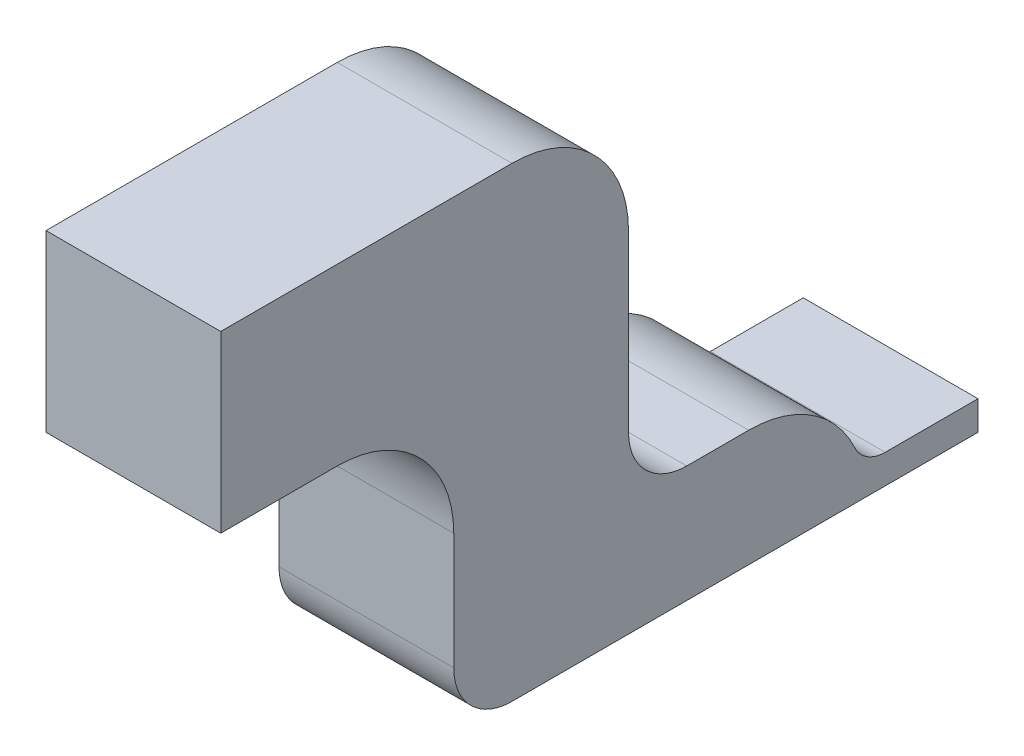
ISO-10303-21;
HEADER;
FILE_DESCRIPTION(('STEP AP214'),'2;1');
FILE_NAME('part.step','',(''),(''),'','','');
FILE_SCHEMA(('AUTOMOTIVE_DESIGN { 1 0 10303 214 1 1 1 1 }'));
ENDSEC;
DATA;
#1=APPLICATION_CONTEXT('core data for automotive mechanical design processes');
#2=APPLICATION_PROTOCOL_DEFINITION('international standard','automotive_design',2000,#1);
#3=PRODUCT_CONTEXT('',#1,'mechanical');
#4=PRODUCT('Part','Part','',(#3));
#5=PRODUCT_RELATED_PRODUCT_CATEGORY('part','',(#4));
#6=PRODUCT_DEFINITION_FORMATION('','',#4);
#7=PRODUCT_DEFINITION_CONTEXT('part definition',#1,'design');
#8=PRODUCT_DEFINITION('design','',#6,#7);
#9=PRODUCT_DEFINITION_SHAPE('','',#8);
#10=(LENGTH_UNIT() NAMED_UNIT(*) SI_UNIT(.MILLI.,.METRE.));
#11=(NAMED_UNIT(*) PLANE_ANGLE_UNIT() SI_UNIT($,.RADIAN.));
#12=(NAMED_UNIT(*) SI_UNIT($,.STERADIAN.) SOLID_ANGLE_UNIT());
#13=UNCERTAINTY_MEASURE_WITH_UNIT(LENGTH_MEASURE(1.E-05),#10,'distance_accuracy_value','');
#14=(GEOMETRIC_REPRESENTATION_CONTEXT(3) GLOBAL_UNCERTAINTY_ASSIGNED_CONTEXT((#13)) GLOBAL_UNIT_ASSIGNED_CONTEXT((#10,
#11,#12)) REPRESENTATION_CONTEXT('',''));
#15=CARTESIAN_POINT('',(0.,0.,0.));
#16=DIRECTION('',(0.,0.,1.));
#17=DIRECTION('',(1.,0.,0.));
#18=AXIS2_PLACEMENT_3D('',#15,#16,#17);
#19=CARTESIAN_POINT('',(0.,0.2,0.));
#20=DIRECTION('',(0.,0.,-1.));
#21=DIRECTION('',(-1.,0.,0.));
#22=AXIS2_PLACEMENT_3D('',#19,#20,#21);
#23=PLANE('',#22);
#24=DIRECTION('',(0.,-1.,0.));
#25=VECTOR('',#24,1.);
#26=CARTESIAN_POINT('',(0.,0.2,0.));
#27=LINE('',#26,#25);
#28=CARTESIAN_POINT('',(0.,0.3,0.));
#29=VERTEX_POINT('',#28);
#30=CARTESIAN_POINT('',(0.,0.1,0.));
#31=VERTEX_POINT('',#30);
#32=EDGE_CURVE('E255',#29,#31,#27,.T.);
#33=ORIENTED_EDGE('',*,*,#32,.T.);
#34=DIRECTION('',(1.,0.,0.));
#35=VECTOR('',#34,1.);
#36=CARTESIAN_POINT('',(0.3,0.1,0.));
#37=LINE('',#36,#35);
#38=CARTESIAN_POINT('',(0.3,0.1,0.));
#39=VERTEX_POINT('',#38);
#40=EDGE_CURVE('E230',#31,#39,#37,.T.);
#41=ORIENTED_EDGE('',*,*,#40,.T.);
#42=DIRECTION('',(0.,-1.,0.));
#43=VECTOR('',#42,1.);
#44=CARTESIAN_POINT('',(0.3,0.2,0.));
#45=LINE('',#44,#43);
#46=CARTESIAN_POINT('',(0.3,0.3,0.));
#47=VERTEX_POINT('',#46);
#48=EDGE_CURVE('E238',#47,#39,#45,.T.);
#49=ORIENTED_EDGE('',*,*,#48,.F.);
#50=DIRECTION('',(1.,0.,0.));
#51=VECTOR('',#50,1.);
#52=CARTESIAN_POINT('',(0.,0.3,0.));
#53=LINE('',#52,#51);
#54=EDGE_CURVE('E245',#47,#29,#53,.F.);
#55=ORIENTED_EDGE('',*,*,#54,.T.);
#56=EDGE_LOOP('',(#33,#41,#49,#55));
#57=FACE_BOUND('',#56,.T.);
#58=ADVANCED_FACE('F32',(#57),#23,.F.);
#59=CARTESIAN_POINT('',(0.,0.2,0.));
#60=DIRECTION('',(0.,-1.,0.));
#61=DIRECTION('',(0.,0.,-1.));
#62=AXIS2_PLACEMENT_3D('',#59,#60,#61);
#63=PLANE('',#62);
#64=DIRECTION('',(0.,0.,-1.));
#65=VECTOR('',#64,1.);
#66=CARTESIAN_POINT('',(0.3,0.2,0.));
#67=LINE('',#66,#65);
#68=CARTESIAN_POINT('',(0.3,0.2,-0.4));
#69=VERTEX_POINT('',#68);
#70=CARTESIAN_POINT('',(0.3,0.2,-0.506350832689628));
#71=VERTEX_POINT('',#70);
#72=EDGE_CURVE('E192',#69,#71,#67,.T.);
#73=ORIENTED_EDGE('',*,*,#72,.T.);
#74=DIRECTION('',(1.,0.,0.));
#75=VECTOR('',#74,1.);
#76=CARTESIAN_POINT('',(0.,0.2,-0.506350832689628));
#77=LINE('',#76,#75);
#78=CARTESIAN_POINT('',(0.,0.2,-0.506350832689628));
#79=VERTEX_POINT('',#78);
#80=EDGE_CURVE('E195',#71,#79,#77,.F.);
#81=ORIENTED_EDGE('',*,*,#80,.T.);
#82=DIRECTION('',(0.,0.,1.));
#83=VECTOR('',#82,1.);
#84=CARTESIAN_POINT('',(0.,0.2,0.));
#85=LINE('',#84,#83);
#86=CARTESIAN_POINT('',(0.,0.2,-0.4));
#87=VERTEX_POINT('',#86);
#88=EDGE_CURVE('E145',#79,#87,#85,.T.);
#89=ORIENTED_EDGE('',*,*,#88,.T.);
#90=DIRECTION('',(-1.,0.,0.));
#91=VECTOR('',#90,1.);
#92=CARTESIAN_POINT('',(0.3,0.2,-0.4));
#93=LINE('',#92,#91);
#94=EDGE_CURVE('E233',#87,#69,#93,.F.);
#95=ORIENTED_EDGE('',*,*,#94,.T.);
#96=EDGE_LOOP('',(#73,#81,#89,#95));
#97=FACE_BOUND('',#96,.T.);
#98=ADVANCED_FACE('F309',(#97),#63,.F.);
#99=CARTESIAN_POINT('',(0.,0.2,0.));
#100=DIRECTION('',(1.,0.,0.));
#101=DIRECTION('',(0.,0.,-1.));
#102=AXIS2_PLACEMENT_3D('',#99,#100,#101);
#103=PLANE('',#102);
#104=ORIENTED_EDGE('',*,*,#88,.F.);
#105=CARTESIAN_POINT('',(0.,0.,-0.506350832689628));
#106=DIRECTION('',(1.,0.,0.));
#107=DIRECTION('',(0.,0.,-1.));
#108=AXIS2_PLACEMENT_3D('',#105,#106,#107);
#109=CIRCLE('',#108,0.2);
#110=CARTESIAN_POINT('',(0.,0.0837209302325581,-0.687984546082806));
#111=VERTEX_POINT('',#110);
#112=EDGE_CURVE('E198',#79,#111,#109,.F.);
#113=ORIENTED_EDGE('',*,*,#112,.T.);
#114=CARTESIAN_POINT('',(0.,0.108,-0.740658322966828));
#115=DIRECTION('',(1.,0.,0.));
#116=DIRECTION('',(0.,0.,-1.));
#117=AXIS2_PLACEMENT_3D('',#114,#115,#116);
#118=CIRCLE('',#117,0.058);
#119=CARTESIAN_POINT('',(0.,0.05,-0.740658322966828));
#120=VERTEX_POINT('',#119);
#121=EDGE_CURVE('E11',#111,#120,#118,.T.);
#122=ORIENTED_EDGE('',*,*,#121,.T.);
#123=DIRECTION('',(0.,0.,1.));
#124=VECTOR('',#123,1.);
#125=CARTESIAN_POINT('',(0.,0.05,-0.899999999999999));
#126=LINE('',#125,#124);
#127=CARTESIAN_POINT('',(0.,0.05,-0.899999999999999));
#128=VERTEX_POINT('',#127);
#129=EDGE_CURVE('E169',#128,#120,#126,.T.);
#130=ORIENTED_EDGE('',*,*,#129,.F.);
#131=DIRECTION('',(0.,1.,0.));
#132=VECTOR('',#131,1.);
#133=CARTESIAN_POINT('',(0.,0.,-0.899999999999999));
#134=LINE('',#133,#132);
#135=CARTESIAN_POINT('',(0.,0.,-0.899999999999999));
#136=VERTEX_POINT('',#135);
#137=EDGE_CURVE('E154',#136,#128,#134,.T.);
#138=ORIENTED_EDGE('',*,*,#137,.F.);
#139=DIRECTION('',(0.,0.,1.));
#140=VECTOR('',#139,1.);
#141=CARTESIAN_POINT('',(0.,0.,0.));
#142=LINE('',#141,#140);
#143=CARTESIAN_POINT('',(0.,0.,-0.1));
#144=VERTEX_POINT('',#143);
#145=EDGE_CURVE('E146',#136,#144,#142,.T.);
#146=ORIENTED_EDGE('',*,*,#145,.T.);
#147=CARTESIAN_POINT('',(0.,0.1,-0.1));
#148=DIRECTION('',(1.,0.,0.));
#149=DIRECTION('',(0.,0.,-1.));
#150=AXIS2_PLACEMENT_3D('',#147,#148,#149);
#151=CIRCLE('',#150,0.1);
#152=EDGE_CURVE('E225',#144,#31,#151,.F.);
#153=ORIENTED_EDGE('',*,*,#152,.T.);
#154=ORIENTED_EDGE('',*,*,#32,.F.);
#155=CARTESIAN_POINT('',(0.,0.3,0.2));
#156=DIRECTION('',(1.,0.,0.));
#157=DIRECTION('',(0.,0.,-1.));
#158=AXIS2_PLACEMENT_3D('',#155,#156,#157);
#159=CIRCLE('',#158,0.2);
#160=CARTESIAN_POINT('',(0.,0.5,0.2));
#161=VERTEX_POINT('',#160);
#162=EDGE_CURVE('E241',#29,#161,#159,.T.);
#163=ORIENTED_EDGE('',*,*,#162,.T.);
#164=DIRECTION('',(0.,0.,-1.));
#165=VECTOR('',#164,1.);
#166=CARTESIAN_POINT('',(0.,0.5,0.4));
#167=LINE('',#166,#165);
#168=CARTESIAN_POINT('',(0.,0.5,0.4));
#169=VERTEX_POINT('',#168);
#170=EDGE_CURVE('E181',#169,#161,#167,.T.);
#171=ORIENTED_EDGE('',*,*,#170,.F.);
#172=DIRECTION('',(0.,-1.,0.));
#173=VECTOR('',#172,1.);
#174=CARTESIAN_POINT('',(0.,0.8,0.4));
#175=LINE('',#174,#173);
#176=CARTESIAN_POINT('',(0.,0.8,0.4));
#177=VERTEX_POINT('',#176);
#178=EDGE_CURVE('E165',#177,#169,#175,.T.);
#179=ORIENTED_EDGE('',*,*,#178,.F.);
#180=DIRECTION('',(0.,0.,1.));
#181=VECTOR('',#180,1.);
#182=CARTESIAN_POINT('',(0.,0.8,0.));
#183=LINE('',#182,#181);
#184=CARTESIAN_POINT('',(0.,0.8,-0.1));
#185=VERTEX_POINT('',#184);
#186=EDGE_CURVE('E178',#185,#177,#183,.T.);
#187=ORIENTED_EDGE('',*,*,#186,.F.);
#188=CARTESIAN_POINT('',(0.,0.6,-0.1));
#189=DIRECTION('',(1.,0.,0.));
#190=DIRECTION('',(0.,0.,-1.));
#191=AXIS2_PLACEMENT_3D('',#188,#189,#190);
#192=CIRCLE('',#191,0.2);
#193=CARTESIAN_POINT('',(0.,0.6,-0.3));
#194=VERTEX_POINT('',#193);
#195=EDGE_CURVE('E272',#185,#194,#192,.F.);
#196=ORIENTED_EDGE('',*,*,#195,.T.);
#197=DIRECTION('',(0.,-1.,0.));
#198=VECTOR('',#197,1.);
#199=CARTESIAN_POINT('',(0.,0.8,-0.3));
#200=LINE('',#199,#198);
#201=CARTESIAN_POINT('',(0.,0.3,-0.3));
#202=VERTEX_POINT('',#201);
#203=EDGE_CURVE('E184',#194,#202,#200,.T.);
#204=ORIENTED_EDGE('',*,*,#203,.T.);
#205=CARTESIAN_POINT('',(0.,0.3,-0.4));
#206=DIRECTION('',(1.,0.,0.));
#207=DIRECTION('',(0.,0.,-1.));
#208=AXIS2_PLACEMENT_3D('',#205,#206,#207);
#209=CIRCLE('',#208,0.1);
#210=EDGE_CURVE('E222',#202,#87,#209,.T.);
#211=ORIENTED_EDGE('',*,*,#210,.T.);
#212=EDGE_LOOP('',(#104,#113,#122,#130,#138,#146,#153,#154,#163,#171,#179,#187,#196,#204,#211));
#213=FACE_BOUND('',#212,.T.);
#214=ADVANCED_FACE('F302',(#213),#103,.F.);
#215=CARTESIAN_POINT('',(0.3,0.2,0.));
#216=DIRECTION('',(-1.,0.,0.));
#217=DIRECTION('',(0.,0.,1.));
#218=AXIS2_PLACEMENT_3D('',#215,#216,#217);
#219=PLANE('',#218);
#220=DIRECTION('',(0.,0.,1.));
#221=VECTOR('',#220,1.);
#222=CARTESIAN_POINT('',(0.3,0.05,-0.899999999999999));
#223=LINE('',#222,#221);
#224=CARTESIAN_POINT('',(0.3,0.05,-0.899999999999999));
#225=VERTEX_POINT('',#224);
#226=CARTESIAN_POINT('',(0.3,0.05,-0.740658322966828));
#227=VERTEX_POINT('',#226);
#228=EDGE_CURVE('E164',#225,#227,#223,.T.);
#229=ORIENTED_EDGE('',*,*,#228,.T.);
#230=CARTESIAN_POINT('',(0.3,0.108,-0.740658322966828));
#231=DIRECTION('',(-1.,0.,0.));
#232=DIRECTION('',(0.,0.,1.));
#233=AXIS2_PLACEMENT_3D('',#230,#231,#232);
#234=CIRCLE('',#233,0.058);
#235=CARTESIAN_POINT('',(0.3,0.0837209302325581,-0.687984546082806));
#236=VERTEX_POINT('',#235);
#237=EDGE_CURVE('E40',#227,#236,#234,.T.);
#238=ORIENTED_EDGE('',*,*,#237,.T.);
#239=CARTESIAN_POINT('',(0.3,0.,-0.506350832689628));
#240=DIRECTION('',(-1.,0.,0.));
#241=DIRECTION('',(0.,0.,1.));
#242=AXIS2_PLACEMENT_3D('',#239,#240,#241);
#243=CIRCLE('',#242,0.2);
#244=EDGE_CURVE('E201',#236,#71,#243,.F.);
#245=ORIENTED_EDGE('',*,*,#244,.T.);
#246=ORIENTED_EDGE('',*,*,#72,.F.);
#247=CARTESIAN_POINT('',(0.3,0.3,-0.4));
#248=DIRECTION('',(-1.,0.,0.));
#249=DIRECTION('',(0.,0.,1.));
#250=AXIS2_PLACEMENT_3D('',#247,#248,#249);
#251=CIRCLE('',#250,0.1);
#252=CARTESIAN_POINT('',(0.3,0.3,-0.3));
#253=VERTEX_POINT('',#252);
#254=EDGE_CURVE('E199',#69,#253,#251,.T.);
#255=ORIENTED_EDGE('',*,*,#254,.T.);
#256=DIRECTION('',(0.,-1.,0.));
#257=VECTOR('',#256,1.);
#258=CARTESIAN_POINT('',(0.3,0.8,-0.3));
#259=LINE('',#258,#257);
#260=CARTESIAN_POINT('',(0.3,0.6,-0.3));
#261=VERTEX_POINT('',#260);
#262=EDGE_CURVE('E271',#261,#253,#259,.T.);
#263=ORIENTED_EDGE('',*,*,#262,.F.);
#264=CARTESIAN_POINT('',(0.3,0.6,-0.1));
#265=DIRECTION('',(-1.,0.,0.));
#266=DIRECTION('',(0.,0.,1.));
#267=AXIS2_PLACEMENT_3D('',#264,#265,#266);
#268=CIRCLE('',#267,0.2);
#269=CARTESIAN_POINT('',(0.3,0.8,-0.1));
#270=VERTEX_POINT('',#269);
#271=EDGE_CURVE('E250',#261,#270,#268,.F.);
#272=ORIENTED_EDGE('',*,*,#271,.T.);
#273=DIRECTION('',(0.,0.,-1.));
#274=VECTOR('',#273,1.);
#275=CARTESIAN_POINT('',(0.3,0.8,0.));
#276=LINE('',#275,#274);
#277=CARTESIAN_POINT('',(0.3,0.8,0.4));
#278=VERTEX_POINT('',#277);
#279=EDGE_CURVE('E180',#278,#270,#276,.T.);
#280=ORIENTED_EDGE('',*,*,#279,.F.);
#281=DIRECTION('',(0.,1.,0.));
#282=VECTOR('',#281,1.);
#283=CARTESIAN_POINT('',(0.3,0.8,0.4));
#284=LINE('',#283,#282);
#285=CARTESIAN_POINT('',(0.3,0.5,0.4));
#286=VERTEX_POINT('',#285);
#287=EDGE_CURVE('E171',#286,#278,#284,.T.);
#288=ORIENTED_EDGE('',*,*,#287,.F.);
#289=DIRECTION('',(0.,0.,-1.));
#290=VECTOR('',#289,1.);
#291=CARTESIAN_POINT('',(0.3,0.5,0.4));
#292=LINE('',#291,#290);
#293=CARTESIAN_POINT('',(0.3,0.5,0.2));
#294=VERTEX_POINT('',#293);
#295=EDGE_CURVE('E177',#286,#294,#292,.T.);
#296=ORIENTED_EDGE('',*,*,#295,.T.);
#297=CARTESIAN_POINT('',(0.3,0.3,0.2));
#298=DIRECTION('',(-1.,0.,0.));
#299=DIRECTION('',(0.,0.,1.));
#300=AXIS2_PLACEMENT_3D('',#297,#298,#299);
#301=CIRCLE('',#300,0.2);
#302=EDGE_CURVE('E243',#294,#47,#301,.T.);
#303=ORIENTED_EDGE('',*,*,#302,.T.);
#304=ORIENTED_EDGE('',*,*,#48,.T.);
#305=CARTESIAN_POINT('',(0.3,0.1,-0.1));
#306=DIRECTION('',(-1.,0.,0.));
#307=DIRECTION('',(0.,0.,1.));
#308=AXIS2_PLACEMENT_3D('',#305,#306,#307);
#309=CIRCLE('',#308,0.1);
#310=CARTESIAN_POINT('',(0.3,0.,-0.1));
#311=VERTEX_POINT('',#310);
#312=EDGE_CURVE('E142',#39,#311,#309,.F.);
#313=ORIENTED_EDGE('',*,*,#312,.T.);
#314=DIRECTION('',(0.,0.,-1.));
#315=VECTOR('',#314,1.);
#316=CARTESIAN_POINT('',(0.3,0.,0.));
#317=LINE('',#316,#315);
#318=CARTESIAN_POINT('',(0.3,0.,-0.899999999999999));
#319=VERTEX_POINT('',#318);
#320=EDGE_CURVE('E136',#311,#319,#317,.T.);
#321=ORIENTED_EDGE('',*,*,#320,.T.);
#322=DIRECTION('',(0.,-1.,0.));
#323=VECTOR('',#322,1.);
#324=CARTESIAN_POINT('',(0.3,0.,-0.899999999999999));
#325=LINE('',#324,#323);
#326=EDGE_CURVE('E140',#225,#319,#325,.T.);
#327=ORIENTED_EDGE('',*,*,#326,.F.);
#328=EDGE_LOOP('',(#229,#238,#245,#246,#255,#263,#272,#280,#288,#296,#303,#304,#313,#321,#327));
#329=FACE_BOUND('',#328,.T.);
#330=ADVANCED_FACE('F138',(#329),#219,.F.);
#331=CARTESIAN_POINT('',(0.,0.,0.));
#332=DIRECTION('',(0.,-1.,0.));
#333=DIRECTION('',(0.,0.,-1.));
#334=AXIS2_PLACEMENT_3D('',#331,#332,#333);
#335=PLANE('',#334);
#336=ORIENTED_EDGE('',*,*,#320,.F.);
#337=DIRECTION('',(1.,0.,0.));
#338=VECTOR('',#337,1.);
#339=CARTESIAN_POINT('',(0.,0.,-0.1));
#340=LINE('',#339,#338);
#341=EDGE_CURVE('E227',#311,#144,#340,.F.);
#342=ORIENTED_EDGE('',*,*,#341,.T.);
#343=ORIENTED_EDGE('',*,*,#145,.F.);
#344=DIRECTION('',(-1.,0.,0.));
#345=VECTOR('',#344,1.);
#346=CARTESIAN_POINT('',(0.3,0.,-0.899999999999999));
#347=LINE('',#346,#345);
#348=EDGE_CURVE('E149',#319,#136,#347,.T.);
#349=ORIENTED_EDGE('',*,*,#348,.F.);
#350=EDGE_LOOP('',(#336,#342,#343,#349));
#351=FACE_BOUND('',#350,.T.);
#352=ADVANCED_FACE('F150',(#351),#335,.T.);
#353=CARTESIAN_POINT('',(0.,0.8,-0.3));
#354=DIRECTION('',(0.,0.,1.));
#355=DIRECTION('',(1.,0.,0.));
#356=AXIS2_PLACEMENT_3D('',#353,#354,#355);
#357=PLANE('',#356);
#358=ORIENTED_EDGE('',*,*,#262,.T.);
#359=DIRECTION('',(-1.,0.,0.));
#360=VECTOR('',#359,1.);
#361=CARTESIAN_POINT('',(0.,0.3,-0.3));
#362=LINE('',#361,#360);
#363=EDGE_CURVE('E235',#253,#202,#362,.T.);
#364=ORIENTED_EDGE('',*,*,#363,.T.);
#365=ORIENTED_EDGE('',*,*,#203,.F.);
#366=DIRECTION('',(-1.,0.,0.));
#367=VECTOR('',#366,1.);
#368=CARTESIAN_POINT('',(0.,0.6,-0.3));
#369=LINE('',#368,#367);
#370=EDGE_CURVE('E252',#194,#261,#369,.F.);
#371=ORIENTED_EDGE('',*,*,#370,.T.);
#372=EDGE_LOOP('',(#358,#364,#365,#371));
#373=FACE_BOUND('',#372,.T.);
#374=ADVANCED_FACE('F350',(#373),#357,.F.);
#375=CARTESIAN_POINT('',(0.,0.8,0.));
#376=DIRECTION('',(0.,-1.,0.));
#377=DIRECTION('',(0.,0.,-1.));
#378=AXIS2_PLACEMENT_3D('',#375,#376,#377);
#379=PLANE('',#378);
#380=ORIENTED_EDGE('',*,*,#279,.T.);
#381=DIRECTION('',(-1.,0.,0.));
#382=VECTOR('',#381,1.);
#383=CARTESIAN_POINT('',(0.,0.8,-0.1));
#384=LINE('',#383,#382);
#385=EDGE_CURVE('E267',#270,#185,#384,.T.);
#386=ORIENTED_EDGE('',*,*,#385,.T.);
#387=ORIENTED_EDGE('',*,*,#186,.T.);
#388=DIRECTION('',(-1.,0.,0.));
#389=VECTOR('',#388,1.);
#390=CARTESIAN_POINT('',(0.,0.8,0.4));
#391=LINE('',#390,#389);
#392=EDGE_CURVE('E174',#278,#177,#391,.T.);
#393=ORIENTED_EDGE('',*,*,#392,.F.);
#394=EDGE_LOOP('',(#380,#386,#387,#393));
#395=FACE_BOUND('',#394,.T.);
#396=ADVANCED_FACE('F347',(#395),#379,.F.);
#397=CARTESIAN_POINT('',(0.,0.5,0.4));
#398=DIRECTION('',(0.,1.,0.));
#399=DIRECTION('',(0.,0.,1.));
#400=AXIS2_PLACEMENT_3D('',#397,#398,#399);
#401=PLANE('',#400);
#402=ORIENTED_EDGE('',*,*,#170,.T.);
#403=DIRECTION('',(1.,0.,0.));
#404=VECTOR('',#403,1.);
#405=CARTESIAN_POINT('',(0.3,0.5,0.2));
#406=LINE('',#405,#404);
#407=EDGE_CURVE('E247',#161,#294,#406,.T.);
#408=ORIENTED_EDGE('',*,*,#407,.T.);
#409=ORIENTED_EDGE('',*,*,#295,.F.);
#410=DIRECTION('',(1.,0.,0.));
#411=VECTOR('',#410,1.);
#412=CARTESIAN_POINT('',(0.,0.5,0.4));
#413=LINE('',#412,#411);
#414=EDGE_CURVE('E168',#169,#286,#413,.T.);
#415=ORIENTED_EDGE('',*,*,#414,.F.);
#416=EDGE_LOOP('',(#402,#408,#409,#415));
#417=FACE_BOUND('',#416,.T.);
#418=ADVANCED_FACE('F285',(#417),#401,.F.);
#419=CARTESIAN_POINT('',(0.,0.,0.4));
#420=DIRECTION('',(0.,0.,1.));
#421=DIRECTION('',(1.,0.,0.));
#422=AXIS2_PLACEMENT_3D('',#419,#420,#421);
#423=PLANE('',#422);
#424=ORIENTED_EDGE('',*,*,#178,.T.);
#425=ORIENTED_EDGE('',*,*,#414,.T.);
#426=ORIENTED_EDGE('',*,*,#287,.T.);
#427=ORIENTED_EDGE('',*,*,#392,.T.);
#428=EDGE_LOOP('',(#424,#425,#426,#427));
#429=FACE_BOUND('',#428,.T.);
#430=ADVANCED_FACE('F324',(#429),#423,.T.);
#431=CARTESIAN_POINT('',(0.,0.6,-0.1));
#432=DIRECTION('',(-1.,0.,0.));
#433=DIRECTION('',(0.,0.,1.));
#434=AXIS2_PLACEMENT_3D('',#431,#432,#433);
#435=CYLINDRICAL_SURFACE('',#434,0.2);
#436=ORIENTED_EDGE('',*,*,#271,.F.);
#437=ORIENTED_EDGE('',*,*,#370,.F.);
#438=ORIENTED_EDGE('',*,*,#195,.F.);
#439=ORIENTED_EDGE('',*,*,#385,.F.);
#440=EDGE_LOOP('',(#436,#437,#438,#439));
#441=FACE_BOUND('',#440,.T.);
#442=ADVANCED_FACE('F321',(#441),#435,.T.);
#443=CARTESIAN_POINT('',(0.,0.3,0.2));
#444=DIRECTION('',(-1.,0.,0.));
#445=DIRECTION('',(0.,0.,1.));
#446=AXIS2_PLACEMENT_3D('',#443,#444,#445);
#447=CYLINDRICAL_SURFACE('',#446,0.2);
#448=ORIENTED_EDGE('',*,*,#162,.F.);
#449=ORIENTED_EDGE('',*,*,#54,.F.);
#450=ORIENTED_EDGE('',*,*,#302,.F.);
#451=ORIENTED_EDGE('',*,*,#407,.F.);
#452=EDGE_LOOP('',(#448,#449,#450,#451));
#453=FACE_BOUND('',#452,.T.);
#454=ADVANCED_FACE('F291',(#453),#447,.F.);
#455=CARTESIAN_POINT('',(0.,0.3,-0.4));
#456=DIRECTION('',(1.,0.,0.));
#457=DIRECTION('',(0.,0.,-1.));
#458=AXIS2_PLACEMENT_3D('',#455,#456,#457);
#459=CYLINDRICAL_SURFACE('',#458,0.1);
#460=ORIENTED_EDGE('',*,*,#254,.F.);
#461=ORIENTED_EDGE('',*,*,#94,.F.);
#462=ORIENTED_EDGE('',*,*,#210,.F.);
#463=ORIENTED_EDGE('',*,*,#363,.F.);
#464=EDGE_LOOP('',(#460,#461,#462,#463));
#465=FACE_BOUND('',#464,.T.);
#466=ADVANCED_FACE('F328',(#465),#459,.F.);
#467=CARTESIAN_POINT('',(0.,0.1,-0.1));
#468=DIRECTION('',(-1.,0.,0.));
#469=DIRECTION('',(0.,0.,1.));
#470=AXIS2_PLACEMENT_3D('',#467,#468,#469);
#471=CYLINDRICAL_SURFACE('',#470,0.1);
#472=ORIENTED_EDGE('',*,*,#152,.F.);
#473=ORIENTED_EDGE('',*,*,#341,.F.);
#474=ORIENTED_EDGE('',*,*,#312,.F.);
#475=ORIENTED_EDGE('',*,*,#40,.F.);
#476=EDGE_LOOP('',(#472,#473,#474,#475));
#477=FACE_BOUND('',#476,.T.);
#478=ADVANCED_FACE('F300',(#477),#471,.T.);
#479=CARTESIAN_POINT('',(0.3,0.05,-0.899999999999999));
#480=DIRECTION('',(0.,-1.,0.));
#481=DIRECTION('',(0.,0.,-1.));
#482=AXIS2_PLACEMENT_3D('',#479,#480,#481);
#483=PLANE('',#482);
#484=ORIENTED_EDGE('',*,*,#129,.T.);
#485=DIRECTION('',(1.,0.,0.));
#486=VECTOR('',#485,1.);
#487=CARTESIAN_POINT('',(0.3,0.05,-0.740658322966828));
#488=LINE('',#487,#486);
#489=EDGE_CURVE('E206',#120,#227,#488,.T.);
#490=ORIENTED_EDGE('',*,*,#489,.T.);
#491=ORIENTED_EDGE('',*,*,#228,.F.);
#492=DIRECTION('',(1.,0.,0.));
#493=VECTOR('',#492,1.);
#494=CARTESIAN_POINT('',(0.3,0.05,-0.899999999999999));
#495=LINE('',#494,#493);
#496=EDGE_CURVE('E158',#128,#225,#495,.T.);
#497=ORIENTED_EDGE('',*,*,#496,.F.);
#498=EDGE_LOOP('',(#484,#490,#491,#497));
#499=FACE_BOUND('',#498,.T.);
#500=ADVANCED_FACE('F213',(#499),#483,.F.);
#501=CARTESIAN_POINT('',(0.,0.,-0.899999999999999));
#502=DIRECTION('',(0.,0.,1.));
#503=DIRECTION('',(1.,0.,0.));
#504=AXIS2_PLACEMENT_3D('',#501,#502,#503);
#505=PLANE('',#504);
#506=ORIENTED_EDGE('',*,*,#326,.T.);
#507=ORIENTED_EDGE('',*,*,#348,.T.);
#508=ORIENTED_EDGE('',*,*,#137,.T.);
#509=ORIENTED_EDGE('',*,*,#496,.T.);
#510=EDGE_LOOP('',(#506,#507,#508,#509));
#511=FACE_BOUND('',#510,.T.);
#512=ADVANCED_FACE('F156',(#511),#505,.F.);
#513=CARTESIAN_POINT('',(0.,0.,-0.506350832689628));
#514=DIRECTION('',(1.,0.,0.));
#515=DIRECTION('',(0.,0.,-1.));
#516=AXIS2_PLACEMENT_3D('',#513,#514,#515);
#517=CYLINDRICAL_SURFACE('',#516,0.2);
#518=ORIENTED_EDGE('',*,*,#244,.F.);
#519=DIRECTION('',(1.,0.,0.));
#520=VECTOR('',#519,1.);
#521=CARTESIAN_POINT('',(0.,0.0837209302325582,-0.687984546082806));
#522=LINE('',#521,#520);
#523=EDGE_CURVE('E47',#236,#111,#522,.F.);
#524=ORIENTED_EDGE('',*,*,#523,.T.);
#525=ORIENTED_EDGE('',*,*,#112,.F.);
#526=ORIENTED_EDGE('',*,*,#80,.F.);
#527=EDGE_LOOP('',(#518,#524,#525,#526));
#528=FACE_BOUND('',#527,.T.);
#529=ADVANCED_FACE('F304',(#528),#517,.T.);
#530=CARTESIAN_POINT('',(0.,0.108,-0.740658322966828));
#531=DIRECTION('',(1.,0.,0.));
#532=DIRECTION('',(0.,0.,-1.));
#533=AXIS2_PLACEMENT_3D('',#530,#531,#532);
#534=CYLINDRICAL_SURFACE('',#533,0.058);
#535=ORIENTED_EDGE('',*,*,#121,.F.);
#536=ORIENTED_EDGE('',*,*,#523,.F.);
#537=ORIENTED_EDGE('',*,*,#237,.F.);
#538=ORIENTED_EDGE('',*,*,#489,.F.);
#539=EDGE_LOOP('',(#535,#536,#537,#538));
#540=FACE_BOUND('',#539,.T.);
#541=ADVANCED_FACE('F34',(#540),#534,.F.);
#542=CLOSED_SHELL('',(#58,#98,#214,#330,#352,#374,#396,#418,#430,#442,#454,#466,#478,#500,#512,
#529,#541));
#543=MANIFOLD_SOLID_BREP('B2',#542);
#544=ADVANCED_BREP_SHAPE_REPRESENTATION('',(#18,#543),#14);
#545=SHAPE_DEFINITION_REPRESENTATION(#9,#544);
ENDSEC;
END-ISO-10303-21;
